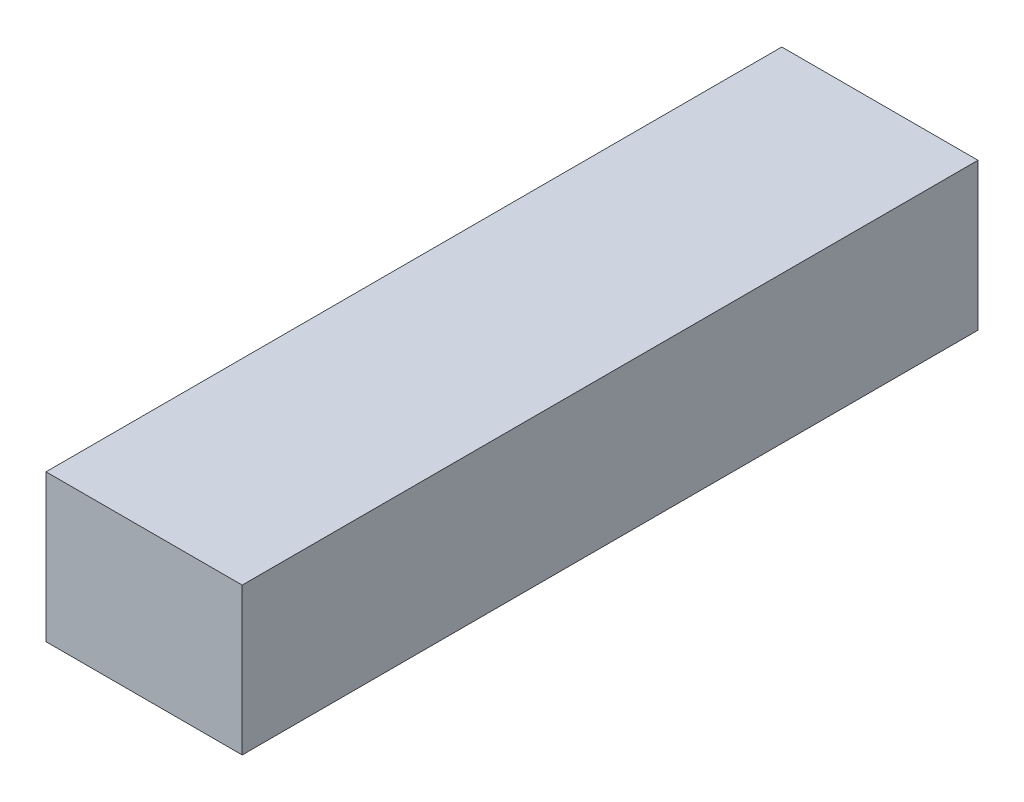
ISO-10303-21;
HEADER;
FILE_DESCRIPTION(('STEP AP214'),'2;1');
FILE_NAME('part.step','',(''),(''),'','','');
FILE_SCHEMA(('AUTOMOTIVE_DESIGN { 1 0 10303 214 1 1 1 1 }'));
ENDSEC;
DATA;
#1=APPLICATION_CONTEXT('core data for automotive mechanical design processes');
#2=APPLICATION_PROTOCOL_DEFINITION('international standard','automotive_design',2000,#1);
#3=PRODUCT_CONTEXT('',#1,'mechanical');
#4=PRODUCT('Part','Part','',(#3));
#5=PRODUCT_RELATED_PRODUCT_CATEGORY('part','',(#4));
#6=PRODUCT_DEFINITION_FORMATION('','',#4);
#7=PRODUCT_DEFINITION_CONTEXT('part definition',#1,'design');
#8=PRODUCT_DEFINITION('design','',#6,#7);
#9=PRODUCT_DEFINITION_SHAPE('','',#8);
#10=(LENGTH_UNIT() NAMED_UNIT(*) SI_UNIT(.MILLI.,.METRE.));
#11=(NAMED_UNIT(*) PLANE_ANGLE_UNIT() SI_UNIT($,.RADIAN.));
#12=(NAMED_UNIT(*) SI_UNIT($,.STERADIAN.) SOLID_ANGLE_UNIT());
#13=UNCERTAINTY_MEASURE_WITH_UNIT(LENGTH_MEASURE(1.E-05),#10,'distance_accuracy_value','');
#14=(GEOMETRIC_REPRESENTATION_CONTEXT(3) GLOBAL_UNCERTAINTY_ASSIGNED_CONTEXT((#13)) GLOBAL_UNIT_ASSIGNED_CONTEXT((#10,
#11,#12)) REPRESENTATION_CONTEXT('',''));
#15=CARTESIAN_POINT('',(0.,0.,0.));
#16=DIRECTION('',(0.,0.,1.));
#17=DIRECTION('',(1.,0.,0.));
#18=AXIS2_PLACEMENT_3D('',#15,#16,#17);
#19=CARTESIAN_POINT('',(20.,30.,-75.0000000000001));
#20=DIRECTION('',(-1.,0.,0.));
#21=DIRECTION('',(0.,0.,1.));
#22=AXIS2_PLACEMENT_3D('',#19,#20,#21);
#23=PLANE('',#22);
#24=DIRECTION('',(0.,0.,-1.));
#25=VECTOR('',#24,1.);
#26=CARTESIAN_POINT('',(20.,0.,-75.0000000000001));
#27=LINE('',#26,#25);
#28=CARTESIAN_POINT('',(20.,0.,75.));
#29=VERTEX_POINT('',#28);
#30=CARTESIAN_POINT('',(20.,0.,-75.0000000000001));
#31=VERTEX_POINT('',#30);
#32=EDGE_CURVE('E98',#29,#31,#27,.T.);
#33=ORIENTED_EDGE('',*,*,#32,.T.);
#34=DIRECTION('',(0.,-1.,0.));
#35=VECTOR('',#34,1.);
#36=CARTESIAN_POINT('',(20.,30.,-75.0000000000001));
#37=LINE('',#36,#35);
#38=CARTESIAN_POINT('',(20.,30.,-75.0000000000001));
#39=VERTEX_POINT('',#38);
#40=EDGE_CURVE('E11',#39,#31,#37,.T.);
#41=ORIENTED_EDGE('',*,*,#40,.F.);
#42=DIRECTION('',(0.,0.,-1.));
#43=VECTOR('',#42,1.);
#44=CARTESIAN_POINT('',(20.,30.,-75.0000000000001));
#45=LINE('',#44,#43);
#46=CARTESIAN_POINT('',(20.,30.,75.));
#47=VERTEX_POINT('',#46);
#48=EDGE_CURVE('E86',#47,#39,#45,.T.);
#49=ORIENTED_EDGE('',*,*,#48,.F.);
#50=DIRECTION('',(0.,-1.,0.));
#51=VECTOR('',#50,1.);
#52=CARTESIAN_POINT('',(20.,30.,75.));
#53=LINE('',#52,#51);
#54=EDGE_CURVE('E94',#47,#29,#53,.T.);
#55=ORIENTED_EDGE('',*,*,#54,.T.);
#56=EDGE_LOOP('',(#33,#41,#49,#55));
#57=FACE_BOUND('',#56,.T.);
#58=ADVANCED_FACE('F35',(#57),#23,.F.);
#59=CARTESIAN_POINT('',(-20.,30.,-75.0000000000001));
#60=DIRECTION('',(0.,0.,1.));
#61=DIRECTION('',(1.,0.,0.));
#62=AXIS2_PLACEMENT_3D('',#59,#60,#61);
#63=PLANE('',#62);
#64=DIRECTION('',(-1.,0.,0.));
#65=VECTOR('',#64,1.);
#66=CARTESIAN_POINT('',(-20.,0.,-75.0000000000001));
#67=LINE('',#66,#65);
#68=CARTESIAN_POINT('',(-20.,0.,-75.0000000000001));
#69=VERTEX_POINT('',#68);
#70=EDGE_CURVE('E90',#31,#69,#67,.T.);
#71=ORIENTED_EDGE('',*,*,#70,.T.);
#72=DIRECTION('',(0.,-1.,0.));
#73=VECTOR('',#72,1.);
#74=CARTESIAN_POINT('',(-20.,30.,-75.0000000000001));
#75=LINE('',#74,#73);
#76=CARTESIAN_POINT('',(-20.,30.,-75.0000000000001));
#77=VERTEX_POINT('',#76);
#78=EDGE_CURVE('E43',#77,#69,#75,.T.);
#79=ORIENTED_EDGE('',*,*,#78,.F.);
#80=DIRECTION('',(-1.,0.,0.));
#81=VECTOR('',#80,1.);
#82=CARTESIAN_POINT('',(-20.,30.,-75.0000000000001));
#83=LINE('',#82,#81);
#84=EDGE_CURVE('E81',#39,#77,#83,.T.);
#85=ORIENTED_EDGE('',*,*,#84,.F.);
#86=ORIENTED_EDGE('',*,*,#40,.T.);
#87=EDGE_LOOP('',(#71,#79,#85,#86));
#88=FACE_BOUND('',#87,.T.);
#89=ADVANCED_FACE('F89',(#88),#63,.F.);
#90=CARTESIAN_POINT('',(-20.,30.,-75.0000000000001));
#91=DIRECTION('',(1.,0.,0.));
#92=DIRECTION('',(0.,0.,-1.));
#93=AXIS2_PLACEMENT_3D('',#90,#91,#92);
#94=PLANE('',#93);
#95=DIRECTION('',(0.,0.,1.));
#96=VECTOR('',#95,1.);
#97=CARTESIAN_POINT('',(-20.,0.,-75.0000000000001));
#98=LINE('',#97,#96);
#99=CARTESIAN_POINT('',(-20.,0.,75.));
#100=VERTEX_POINT('',#99);
#101=EDGE_CURVE('E68',#69,#100,#98,.T.);
#102=ORIENTED_EDGE('',*,*,#101,.T.);
#103=DIRECTION('',(0.,-1.,0.));
#104=VECTOR('',#103,1.);
#105=CARTESIAN_POINT('',(-20.,30.,75.));
#106=LINE('',#105,#104);
#107=CARTESIAN_POINT('',(-20.,30.,75.));
#108=VERTEX_POINT('',#107);
#109=EDGE_CURVE('E91',#108,#100,#106,.T.);
#110=ORIENTED_EDGE('',*,*,#109,.F.);
#111=DIRECTION('',(0.,0.,1.));
#112=VECTOR('',#111,1.);
#113=CARTESIAN_POINT('',(-20.,30.,-75.0000000000001));
#114=LINE('',#113,#112);
#115=EDGE_CURVE('E84',#77,#108,#114,.T.);
#116=ORIENTED_EDGE('',*,*,#115,.F.);
#117=ORIENTED_EDGE('',*,*,#78,.T.);
#118=EDGE_LOOP('',(#102,#110,#116,#117));
#119=FACE_BOUND('',#118,.T.);
#120=ADVANCED_FACE('F92',(#119),#94,.F.);
#121=CARTESIAN_POINT('',(-20.,30.,75.));
#122=DIRECTION('',(0.,0.,-1.));
#123=DIRECTION('',(-1.,0.,0.));
#124=AXIS2_PLACEMENT_3D('',#121,#122,#123);
#125=PLANE('',#124);
#126=DIRECTION('',(1.,0.,0.));
#127=VECTOR('',#126,1.);
#128=CARTESIAN_POINT('',(-20.,0.,75.));
#129=LINE('',#128,#127);
#130=EDGE_CURVE('E74',#100,#29,#129,.T.);
#131=ORIENTED_EDGE('',*,*,#130,.T.);
#132=ORIENTED_EDGE('',*,*,#54,.F.);
#133=DIRECTION('',(1.,0.,0.));
#134=VECTOR('',#133,1.);
#135=CARTESIAN_POINT('',(-20.,30.,75.));
#136=LINE('',#135,#134);
#137=EDGE_CURVE('E51',#108,#47,#136,.T.);
#138=ORIENTED_EDGE('',*,*,#137,.F.);
#139=ORIENTED_EDGE('',*,*,#109,.T.);
#140=EDGE_LOOP('',(#131,#132,#138,#139));
#141=FACE_BOUND('',#140,.T.);
#142=ADVANCED_FACE('F105',(#141),#125,.F.);
#143=CARTESIAN_POINT('',(0.,30.,0.));
#144=DIRECTION('',(0.,1.,0.));
#145=DIRECTION('',(0.,0.,1.));
#146=AXIS2_PLACEMENT_3D('',#143,#144,#145);
#147=PLANE('',#146);
#148=ORIENTED_EDGE('',*,*,#48,.T.);
#149=ORIENTED_EDGE('',*,*,#84,.T.);
#150=ORIENTED_EDGE('',*,*,#115,.T.);
#151=ORIENTED_EDGE('',*,*,#137,.T.);
#152=EDGE_LOOP('',(#148,#149,#150,#151));
#153=FACE_BOUND('',#152,.T.);
#154=ADVANCED_FACE('F82',(#153),#147,.T.);
#155=CARTESIAN_POINT('',(0.,0.,0.));
#156=DIRECTION('',(0.,1.,0.));
#157=DIRECTION('',(0.,0.,1.));
#158=AXIS2_PLACEMENT_3D('',#155,#156,#157);
#159=PLANE('',#158);
#160=ORIENTED_EDGE('',*,*,#32,.F.);
#161=ORIENTED_EDGE('',*,*,#130,.F.);
#162=ORIENTED_EDGE('',*,*,#101,.F.);
#163=ORIENTED_EDGE('',*,*,#70,.F.);
#164=EDGE_LOOP('',(#160,#161,#162,#163));
#165=FACE_BOUND('',#164,.T.);
#166=ADVANCED_FACE('F108',(#165),#159,.F.);
#167=CLOSED_SHELL('',(#58,#89,#120,#142,#154,#166));
#168=MANIFOLD_SOLID_BREP('B2',#167);
#169=ADVANCED_BREP_SHAPE_REPRESENTATION('',(#18,#168),#14);
#170=SHAPE_DEFINITION_REPRESENTATION(#9,#169);
ENDSEC;
END-ISO-10303-21;
